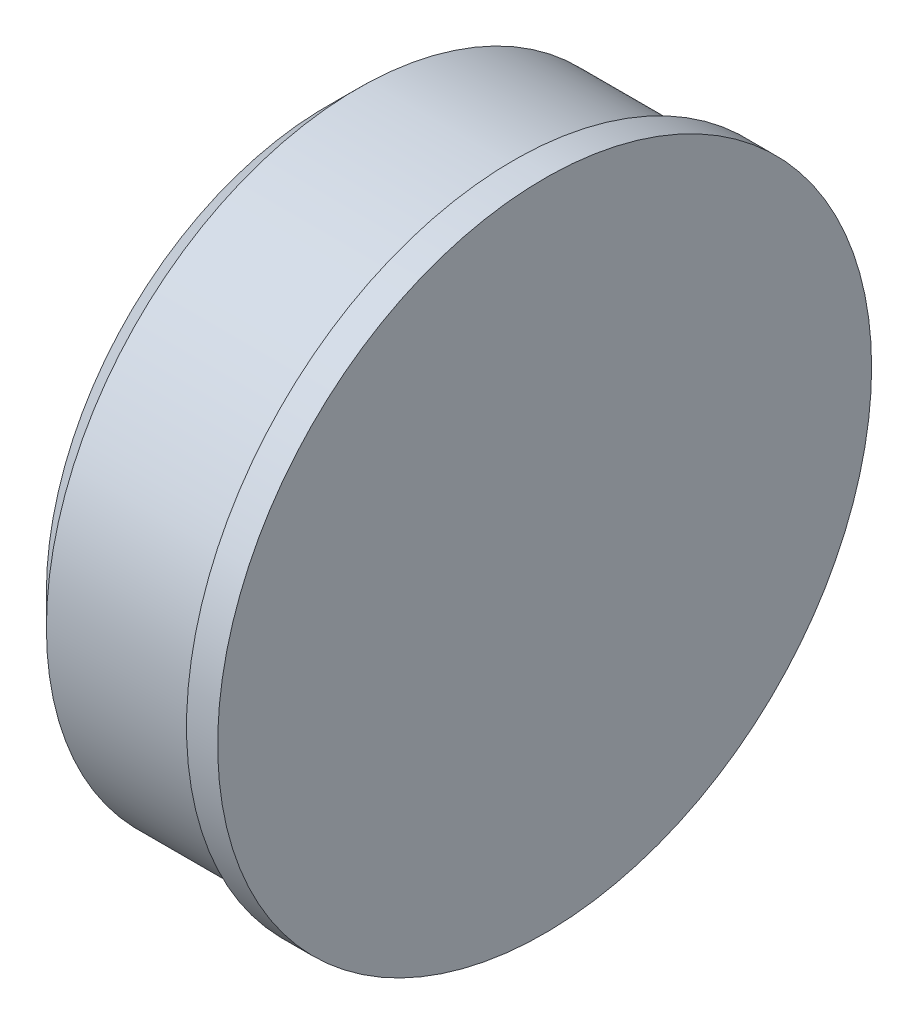
ISO-10303-21;
HEADER;
FILE_DESCRIPTION(('STEP AP214'),'2;1');
FILE_NAME('part.step','',(''),(''),'','','');
FILE_SCHEMA(('AUTOMOTIVE_DESIGN { 1 0 10303 214 1 1 1 1 }'));
ENDSEC;
DATA;
#1=APPLICATION_CONTEXT('core data for automotive mechanical design processes');
#2=APPLICATION_PROTOCOL_DEFINITION('international standard','automotive_design',2000,#1);
#3=PRODUCT_CONTEXT('',#1,'mechanical');
#4=PRODUCT('Part','Part','',(#3));
#5=PRODUCT_RELATED_PRODUCT_CATEGORY('part','',(#4));
#6=PRODUCT_DEFINITION_FORMATION('','',#4);
#7=PRODUCT_DEFINITION_CONTEXT('part definition',#1,'design');
#8=PRODUCT_DEFINITION('design','',#6,#7);
#9=PRODUCT_DEFINITION_SHAPE('','',#8);
#10=(LENGTH_UNIT() NAMED_UNIT(*) SI_UNIT(.MILLI.,.METRE.));
#11=(NAMED_UNIT(*) PLANE_ANGLE_UNIT() SI_UNIT($,.RADIAN.));
#12=(NAMED_UNIT(*) SI_UNIT($,.STERADIAN.) SOLID_ANGLE_UNIT());
#13=UNCERTAINTY_MEASURE_WITH_UNIT(LENGTH_MEASURE(1.E-05),#10,'distance_accuracy_value','');
#14=(GEOMETRIC_REPRESENTATION_CONTEXT(3) GLOBAL_UNCERTAINTY_ASSIGNED_CONTEXT((#13)) GLOBAL_UNIT_ASSIGNED_CONTEXT((#10,
#11,#12)) REPRESENTATION_CONTEXT('',''));
#15=CARTESIAN_POINT('',(0.,0.,0.));
#16=DIRECTION('',(0.,0.,1.));
#17=DIRECTION('',(1.,0.,0.));
#18=AXIS2_PLACEMENT_3D('',#15,#16,#17);
#19=CARTESIAN_POINT('',(0.,0.,0.));
#20=DIRECTION('',(1.,0.,0.));
#21=DIRECTION('',(0.,0.,-1.));
#22=AXIS2_PLACEMENT_3D('',#19,#20,#21);
#23=PLANE('',#22);
#24=CARTESIAN_POINT('',(0.,0.,0.));
#25=DIRECTION('',(1.,0.,0.));
#26=DIRECTION('',(0.,0.,-1.));
#27=AXIS2_PLACEMENT_3D('',#24,#25,#26);
#28=CIRCLE('',#27,10.5);
#29=CARTESIAN_POINT('',(0.,0.,-10.5));
#30=VERTEX_POINT('',#29);
#31=EDGE_CURVE('E45',#30,#30,#28,.T.);
#32=ORIENTED_EDGE('',*,*,#31,.F.);
#33=EDGE_LOOP('',(#32));
#34=FACE_BOUND('',#33,.T.);
#35=CARTESIAN_POINT('',(0.,0.,0.));
#36=DIRECTION('',(1.,0.,0.));
#37=DIRECTION('',(0.,0.,-1.));
#38=AXIS2_PLACEMENT_3D('',#35,#36,#37);
#39=CIRCLE('',#38,10.);
#40=CARTESIAN_POINT('',(0.,0.,-10.));
#41=VERTEX_POINT('',#40);
#42=EDGE_CURVE('E36',#41,#41,#39,.F.);
#43=ORIENTED_EDGE('',*,*,#42,.F.);
#44=EDGE_LOOP('',(#43));
#45=FACE_BOUND('',#44,.T.);
#46=ADVANCED_FACE('F25',(#34,#45),#23,.F.);
#47=CARTESIAN_POINT('',(1.,0.,0.));
#48=DIRECTION('',(-1.,0.,0.));
#49=DIRECTION('',(0.,0.,1.));
#50=AXIS2_PLACEMENT_3D('',#47,#48,#49);
#51=CYLINDRICAL_SURFACE('',#50,10.5);
#52=CARTESIAN_POINT('',(1.,0.,0.));
#53=DIRECTION('',(1.,0.,0.));
#54=DIRECTION('',(0.,0.,-1.));
#55=AXIS2_PLACEMENT_3D('',#52,#53,#54);
#56=CIRCLE('',#55,10.5);
#57=CARTESIAN_POINT('',(1.,0.,-10.5));
#58=VERTEX_POINT('',#57);
#59=EDGE_CURVE('E40',#58,#58,#56,.T.);
#60=ORIENTED_EDGE('',*,*,#59,.F.);
#61=EDGE_LOOP('',(#60));
#62=FACE_BOUND('',#61,.T.);
#63=ORIENTED_EDGE('',*,*,#31,.T.);
#64=EDGE_LOOP('',(#63));
#65=FACE_BOUND('',#64,.T.);
#66=ADVANCED_FACE('F27',(#62,#65),#51,.T.);
#67=CARTESIAN_POINT('',(1.,0.,0.));
#68=DIRECTION('',(1.,0.,0.));
#69=DIRECTION('',(0.,0.,-1.));
#70=AXIS2_PLACEMENT_3D('',#67,#68,#69);
#71=PLANE('',#70);
#72=ORIENTED_EDGE('',*,*,#59,.T.);
#73=EDGE_LOOP('',(#72));
#74=FACE_BOUND('',#73,.T.);
#75=ADVANCED_FACE('F78',(#74),#71,.T.);
#76=CARTESIAN_POINT('',(-6.,0.,0.));
#77=DIRECTION('',(-1.,0.,0.));
#78=DIRECTION('',(0.,0.,1.));
#79=AXIS2_PLACEMENT_3D('',#76,#77,#78);
#80=PLANE('',#79);
#81=CARTESIAN_POINT('',(-6.,0.,0.));
#82=DIRECTION('',(-1.,0.,0.));
#83=DIRECTION('',(0.,0.,1.));
#84=AXIS2_PLACEMENT_3D('',#81,#82,#83);
#85=CIRCLE('',#84,8.99999999999999);
#86=CARTESIAN_POINT('',(-6.,0.,8.99999999999999));
#87=VERTEX_POINT('',#86);
#88=EDGE_CURVE('E32',#87,#87,#85,.T.);
#89=ORIENTED_EDGE('',*,*,#88,.T.);
#90=EDGE_LOOP('',(#89));
#91=FACE_BOUND('',#90,.T.);
#92=CARTESIAN_POINT('',(-6.,0.,0.));
#93=DIRECTION('',(-1.,0.,0.));
#94=DIRECTION('',(0.,0.,1.));
#95=AXIS2_PLACEMENT_3D('',#92,#93,#94);
#96=CIRCLE('',#95,7.75);
#97=CARTESIAN_POINT('',(-6.,0.,7.75));
#98=VERTEX_POINT('',#97);
#99=EDGE_CURVE('E48',#98,#98,#96,.T.);
#100=ORIENTED_EDGE('',*,*,#99,.F.);
#101=EDGE_LOOP('',(#100));
#102=FACE_BOUND('',#101,.T.);
#103=ADVANCED_FACE('F69',(#91,#102),#80,.T.);
#104=CARTESIAN_POINT('',(-6.,0.,0.));
#105=DIRECTION('',(1.,0.,0.));
#106=DIRECTION('',(0.,0.,-1.));
#107=AXIS2_PLACEMENT_3D('',#104,#105,#106);
#108=CYLINDRICAL_SURFACE('',#107,10.);
#109=CARTESIAN_POINT('',(-4.99999999999999,0.,0.));
#110=DIRECTION('',(-1.,0.,0.));
#111=DIRECTION('',(0.,0.,1.));
#112=AXIS2_PLACEMENT_3D('',#109,#110,#111);
#113=CIRCLE('',#112,10.);
#114=CARTESIAN_POINT('',(-4.99999999999999,0.,10.));
#115=VERTEX_POINT('',#114);
#116=EDGE_CURVE('E10',#115,#115,#113,.F.);
#117=ORIENTED_EDGE('',*,*,#116,.T.);
#118=EDGE_LOOP('',(#117));
#119=FACE_BOUND('',#118,.T.);
#120=ORIENTED_EDGE('',*,*,#42,.T.);
#121=EDGE_LOOP('',(#120));
#122=FACE_BOUND('',#121,.T.);
#123=ADVANCED_FACE('F59',(#119,#122),#108,.T.);
#124=CARTESIAN_POINT('',(-6.,0.,0.));
#125=DIRECTION('',(1.,0.,0.));
#126=DIRECTION('',(0.,0.,-1.));
#127=AXIS2_PLACEMENT_3D('',#124,#125,#126);
#128=CYLINDRICAL_SURFACE('',#127,7.75);
#129=ORIENTED_EDGE('',*,*,#99,.T.);
#130=EDGE_LOOP('',(#129));
#131=FACE_BOUND('',#130,.T.);
#132=CARTESIAN_POINT('',(0.,0.,0.));
#133=DIRECTION('',(-1.,0.,0.));
#134=DIRECTION('',(0.,0.,1.));
#135=AXIS2_PLACEMENT_3D('',#132,#133,#134);
#136=CIRCLE('',#135,7.75);
#137=CARTESIAN_POINT('',(0.,0.,7.75));
#138=VERTEX_POINT('',#137);
#139=EDGE_CURVE('E51',#138,#138,#136,.T.);
#140=ORIENTED_EDGE('',*,*,#139,.F.);
#141=EDGE_LOOP('',(#140));
#142=FACE_BOUND('',#141,.T.);
#143=ADVANCED_FACE('F57',(#131,#142),#128,.F.);
#144=ORIENTED_EDGE('',*,*,#139,.T.);
#145=EDGE_LOOP('',(#144));
#146=FACE_BOUND('',#145,.T.);
#147=ADVANCED_FACE('F55',(#146),#23,.F.);
#148=CARTESIAN_POINT('',(-6.,0.,0.));
#149=DIRECTION('',(1.,0.,0.));
#150=DIRECTION('',(0.,0.,-1.));
#151=AXIS2_PLACEMENT_3D('',#148,#149,#150);
#152=CONICAL_SURFACE('',#151,8.99999999999999,0.785398163397447);
#153=ORIENTED_EDGE('',*,*,#116,.F.);
#154=EDGE_LOOP('',(#153));
#155=FACE_BOUND('',#154,.T.);
#156=ORIENTED_EDGE('',*,*,#88,.F.);
#157=EDGE_LOOP('',(#156));
#158=FACE_BOUND('',#157,.T.);
#159=ADVANCED_FACE('F66',(#155,#158),#152,.T.);
#160=CLOSED_SHELL('',(#46,#66,#75,#103,#123,#143,#147,#159));
#161=MANIFOLD_SOLID_BREP('B2',#160);
#162=ADVANCED_BREP_SHAPE_REPRESENTATION('',(#18,#161),#14);
#163=SHAPE_DEFINITION_REPRESENTATION(#9,#162);
ENDSEC;
END-ISO-10303-21;
